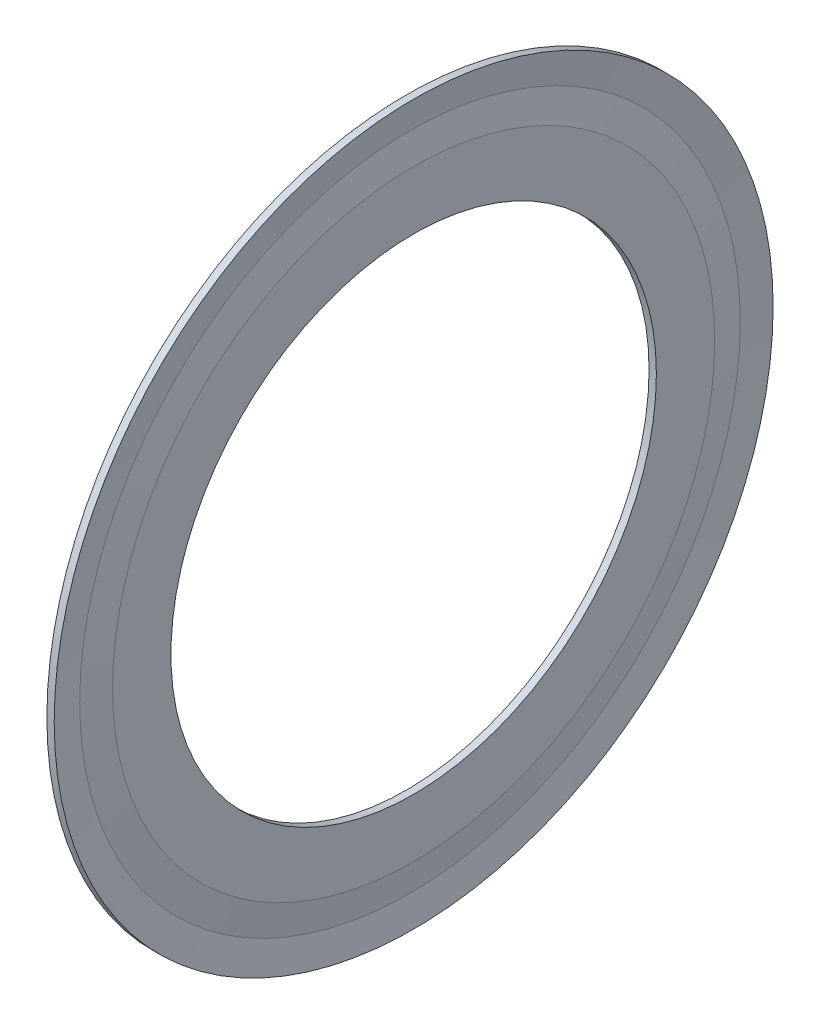
ISO-10303-21;
HEADER;
FILE_DESCRIPTION(('STEP AP214'),'2;1');
FILE_NAME('part.step','',(''),(''),'','','');
FILE_SCHEMA(('AUTOMOTIVE_DESIGN { 1 0 10303 214 1 1 1 1 }'));
ENDSEC;
DATA;
#1=APPLICATION_CONTEXT('core data for automotive mechanical design processes');
#2=APPLICATION_PROTOCOL_DEFINITION('international standard','automotive_design',2000,#1);
#3=PRODUCT_CONTEXT('',#1,'mechanical');
#4=PRODUCT('Part','Part','',(#3));
#5=PRODUCT_RELATED_PRODUCT_CATEGORY('part','',(#4));
#6=PRODUCT_DEFINITION_FORMATION('','',#4);
#7=PRODUCT_DEFINITION_CONTEXT('part definition',#1,'design');
#8=PRODUCT_DEFINITION('design','',#6,#7);
#9=PRODUCT_DEFINITION_SHAPE('','',#8);
#10=(LENGTH_UNIT() NAMED_UNIT(*) SI_UNIT(.MILLI.,.METRE.));
#11=(NAMED_UNIT(*) PLANE_ANGLE_UNIT() SI_UNIT($,.RADIAN.));
#12=(NAMED_UNIT(*) SI_UNIT($,.STERADIAN.) SOLID_ANGLE_UNIT());
#13=UNCERTAINTY_MEASURE_WITH_UNIT(LENGTH_MEASURE(1.E-05),#10,'distance_accuracy_value','');
#14=(GEOMETRIC_REPRESENTATION_CONTEXT(3) GLOBAL_UNCERTAINTY_ASSIGNED_CONTEXT((#13)) GLOBAL_UNIT_ASSIGNED_CONTEXT((#10,
#11,#12)) REPRESENTATION_CONTEXT('',''));
#15=CARTESIAN_POINT('',(0.,0.,0.));
#16=DIRECTION('',(0.,0.,1.));
#17=DIRECTION('',(1.,0.,0.));
#18=AXIS2_PLACEMENT_3D('',#15,#16,#17);
#19=CARTESIAN_POINT('',(2.7317481392405,3.31995724045634,0.));
#20=DIRECTION('',(-1.,0.,0.));
#21=DIRECTION('',(0.,0.,1.));
#22=AXIS2_PLACEMENT_3D('',#19,#20,#21);
#23=PLANE('',#22);
#24=CARTESIAN_POINT('',(2.7317481392405,0.,0.));
#25=DIRECTION('',(1.,0.,0.));
#26=DIRECTION('',(0.,0.,-1.));
#27=AXIS2_PLACEMENT_3D('',#24,#25,#26);
#28=CIRCLE('',#27,3.03924050632911);
#29=CARTESIAN_POINT('',(2.7317481392405,0.,-3.03924050632911));
#30=VERTEX_POINT('',#29);
#31=EDGE_CURVE('E10',#30,#30,#28,.T.);
#32=ORIENTED_EDGE('',*,*,#31,.T.);
#33=EDGE_LOOP('',(#32));
#34=FACE_BOUND('',#33,.T.);
#35=CARTESIAN_POINT('',(2.7317481392405,0.,0.));
#36=DIRECTION('',(1.,0.,0.));
#37=DIRECTION('',(0.,0.,-1.));
#38=AXIS2_PLACEMENT_3D('',#35,#36,#37);
#39=CIRCLE('',#38,3.31995724045634);
#40=CARTESIAN_POINT('',(2.7317481392405,0.,-3.31995724045634));
#41=VERTEX_POINT('',#40);
#42=EDGE_CURVE('E61',#41,#41,#39,.T.);
#43=ORIENTED_EDGE('',*,*,#42,.F.);
#44=EDGE_LOOP('',(#43));
#45=FACE_BOUND('',#44,.T.);
#46=ADVANCED_FACE('F33',(#34,#45),#23,.T.);
#47=CARTESIAN_POINT('',(2.7317481392405,0.,0.));
#48=DIRECTION('',(-1.,0.,0.));
#49=DIRECTION('',(0.,0.,1.));
#50=AXIS2_PLACEMENT_3D('',#47,#48,#49);
#51=CONICAL_SURFACE('',#50,3.03924050632911,1.44602677885602);
#52=CARTESIAN_POINT('',(2.80565130379747,0.,0.));
#53=DIRECTION('',(1.,0.,0.));
#54=DIRECTION('',(0.,0.,-1.));
#55=AXIS2_PLACEMENT_3D('',#52,#53,#54);
#56=CIRCLE('',#55,2.45);
#57=CARTESIAN_POINT('',(2.80565130379747,0.,-2.45));
#58=VERTEX_POINT('',#57);
#59=EDGE_CURVE('E39',#58,#58,#56,.T.);
#60=ORIENTED_EDGE('',*,*,#59,.T.);
#61=EDGE_LOOP('',(#60));
#62=FACE_BOUND('',#61,.T.);
#63=ORIENTED_EDGE('',*,*,#31,.F.);
#64=EDGE_LOOP('',(#63));
#65=FACE_BOUND('',#64,.T.);
#66=ADVANCED_FACE('F69',(#62,#65),#51,.F.);
#67=CARTESIAN_POINT('',(31.012658227848,0.,0.));
#68=DIRECTION('',(1.,0.,0.));
#69=DIRECTION('',(0.,0.,-1.));
#70=AXIS2_PLACEMENT_3D('',#67,#68,#69);
#71=CYLINDRICAL_SURFACE('',#70,2.45);
#72=CARTESIAN_POINT('',(2.87955446835442,0.,0.));
#73=DIRECTION('',(1.,0.,0.));
#74=DIRECTION('',(0.,0.,-1.));
#75=AXIS2_PLACEMENT_3D('',#72,#73,#74);
#76=CIRCLE('',#75,2.45);
#77=CARTESIAN_POINT('',(2.87955446835442,0.,-2.45));
#78=VERTEX_POINT('',#77);
#79=EDGE_CURVE('E43',#78,#78,#76,.T.);
#80=ORIENTED_EDGE('',*,*,#79,.T.);
#81=EDGE_LOOP('',(#80));
#82=FACE_BOUND('',#81,.T.);
#83=ORIENTED_EDGE('',*,*,#59,.F.);
#84=EDGE_LOOP('',(#83));
#85=FACE_BOUND('',#84,.T.);
#86=ADVANCED_FACE('F73',(#82,#85),#71,.F.);
#87=CARTESIAN_POINT('',(2.87955446835443,2.45,0.));
#88=DIRECTION('',(1.,0.,0.));
#89=DIRECTION('',(0.,0.,-1.));
#90=AXIS2_PLACEMENT_3D('',#87,#88,#89);
#91=PLANE('',#90);
#92=CARTESIAN_POINT('',(2.87955446835442,0.,0.));
#93=DIRECTION('',(1.,0.,0.));
#94=DIRECTION('',(0.,0.,-1.));
#95=AXIS2_PLACEMENT_3D('',#92,#93,#94);
#96=CIRCLE('',#95,3.03924050632911);
#97=CARTESIAN_POINT('',(2.87955446835442,0.,-3.03924050632911));
#98=VERTEX_POINT('',#97);
#99=EDGE_CURVE('E47',#98,#98,#96,.T.);
#100=ORIENTED_EDGE('',*,*,#99,.T.);
#101=EDGE_LOOP('',(#100));
#102=FACE_BOUND('',#101,.T.);
#103=ORIENTED_EDGE('',*,*,#79,.F.);
#104=EDGE_LOOP('',(#103));
#105=FACE_BOUND('',#104,.T.);
#106=ADVANCED_FACE('F77',(#102,#105),#91,.T.);
#107=CARTESIAN_POINT('',(2.87955446835442,0.,0.));
#108=DIRECTION('',(-1.,0.,0.));
#109=DIRECTION('',(0.,0.,1.));
#110=AXIS2_PLACEMENT_3D('',#107,#108,#109);
#111=CONICAL_SURFACE('',#110,3.03924050632911,1.44602677885603);
#112=CARTESIAN_POINT('',(2.84260288607594,0.,0.));
#113=DIRECTION('',(1.,0.,0.));
#114=DIRECTION('',(0.,0.,-1.));
#115=AXIS2_PLACEMENT_3D('',#112,#113,#114);
#116=CIRCLE('',#115,3.33386075949367);
#117=CARTESIAN_POINT('',(2.84260288607594,0.,-3.33386075949367));
#118=VERTEX_POINT('',#117);
#119=EDGE_CURVE('E52',#118,#118,#116,.T.);
#120=ORIENTED_EDGE('',*,*,#119,.T.);
#121=EDGE_LOOP('',(#120));
#122=FACE_BOUND('',#121,.T.);
#123=ORIENTED_EDGE('',*,*,#99,.F.);
#124=EDGE_LOOP('',(#123));
#125=FACE_BOUND('',#124,.T.);
#126=ADVANCED_FACE('F84',(#122,#125),#111,.T.);
#127=CARTESIAN_POINT('',(2.84260288607594,0.,0.));
#128=DIRECTION('',(1.,0.,0.));
#129=DIRECTION('',(0.,0.,-1.));
#130=AXIS2_PLACEMENT_3D('',#127,#128,#129);
#131=CONICAL_SURFACE('',#130,3.33386075949367,1.44602677885603);
#132=CARTESIAN_POINT('',(2.87955446835442,0.,0.));
#133=DIRECTION('',(1.,0.,0.));
#134=DIRECTION('',(0.,0.,-1.));
#135=AXIS2_PLACEMENT_3D('',#132,#133,#134);
#136=CIRCLE('',#135,3.62848101265822);
#137=CARTESIAN_POINT('',(2.87955446835442,0.,-3.62848101265822));
#138=VERTEX_POINT('',#137);
#139=EDGE_CURVE('E55',#138,#138,#136,.T.);
#140=ORIENTED_EDGE('',*,*,#139,.T.);
#141=EDGE_LOOP('',(#140));
#142=FACE_BOUND('',#141,.T.);
#143=ORIENTED_EDGE('',*,*,#119,.F.);
#144=EDGE_LOOP('',(#143));
#145=FACE_BOUND('',#144,.T.);
#146=ADVANCED_FACE('F88',(#142,#145),#131,.F.);
#147=CARTESIAN_POINT('',(31.012658227848,0.,0.));
#148=DIRECTION('',(1.,0.,0.));
#149=DIRECTION('',(0.,0.,-1.));
#150=AXIS2_PLACEMENT_3D('',#147,#148,#149);
#151=CYLINDRICAL_SURFACE('',#150,3.62848101265822);
#152=CARTESIAN_POINT('',(2.80565130379747,0.,0.));
#153=DIRECTION('',(1.,0.,0.));
#154=DIRECTION('',(0.,0.,-1.));
#155=AXIS2_PLACEMENT_3D('',#152,#153,#154);
#156=CIRCLE('',#155,3.62848101265822);
#157=CARTESIAN_POINT('',(2.80565130379747,0.,-3.62848101265822));
#158=VERTEX_POINT('',#157);
#159=EDGE_CURVE('E58',#158,#158,#156,.T.);
#160=ORIENTED_EDGE('',*,*,#159,.T.);
#161=EDGE_LOOP('',(#160));
#162=FACE_BOUND('',#161,.T.);
#163=ORIENTED_EDGE('',*,*,#139,.F.);
#164=EDGE_LOOP('',(#163));
#165=FACE_BOUND('',#164,.T.);
#166=ADVANCED_FACE('F92',(#162,#165),#151,.T.);
#167=CARTESIAN_POINT('',(2.80565130379747,0.,0.));
#168=DIRECTION('',(1.,0.,0.));
#169=DIRECTION('',(0.,0.,-1.));
#170=AXIS2_PLACEMENT_3D('',#167,#168,#169);
#171=CONICAL_SURFACE('',#170,3.62848101265822,1.33568823852215);
#172=ORIENTED_EDGE('',*,*,#42,.T.);
#173=EDGE_LOOP('',(#172));
#174=FACE_BOUND('',#173,.T.);
#175=ORIENTED_EDGE('',*,*,#159,.F.);
#176=EDGE_LOOP('',(#175));
#177=FACE_BOUND('',#176,.T.);
#178=ADVANCED_FACE('F65',(#174,#177),#171,.T.);
#179=CLOSED_SHELL('',(#46,#66,#86,#106,#126,#146,#166,#178));
#180=MANIFOLD_SOLID_BREP('B2',#179);
#181=ADVANCED_BREP_SHAPE_REPRESENTATION('',(#18,#180),#14);
#182=SHAPE_DEFINITION_REPRESENTATION(#9,#181);
ENDSEC;
END-ISO-10303-21;
